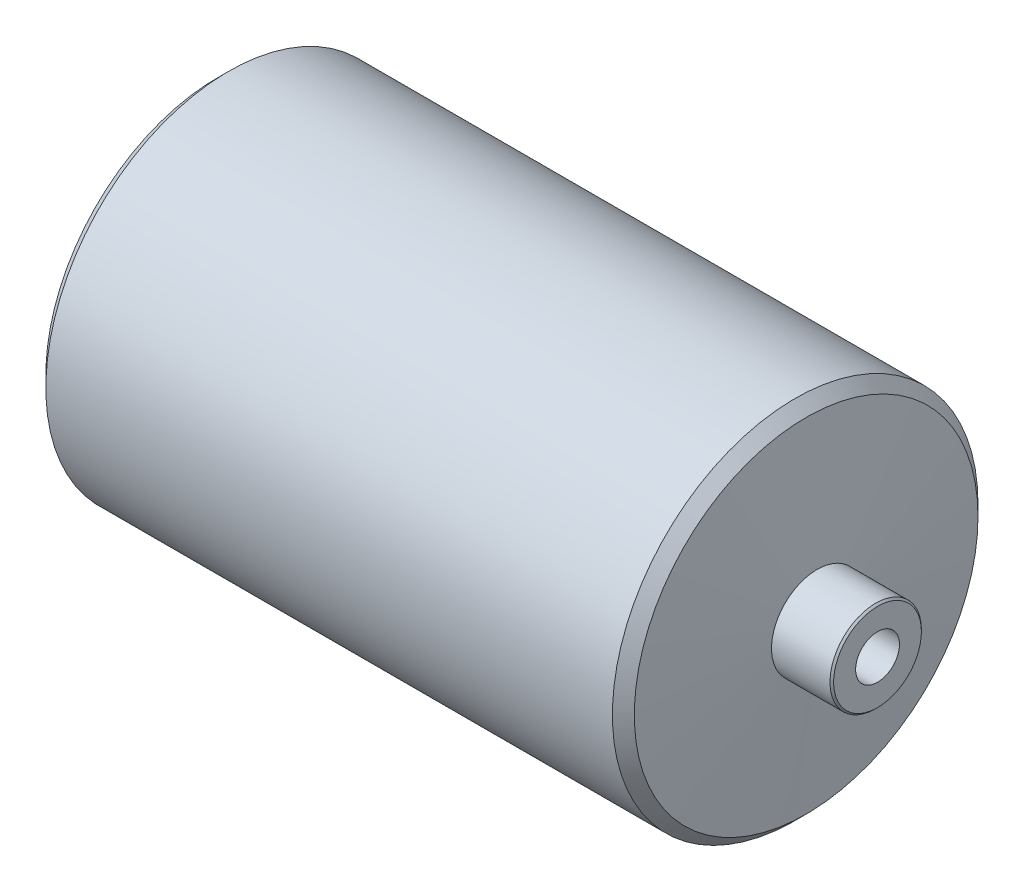
ISO-10303-21;
HEADER;
FILE_DESCRIPTION(('STEP AP214'),'2;1');
FILE_NAME('part.step','',(''),(''),'','','');
FILE_SCHEMA(('AUTOMOTIVE_DESIGN { 1 0 10303 214 1 1 1 1 }'));
ENDSEC;
DATA;
#1=APPLICATION_CONTEXT('core data for automotive mechanical design processes');
#2=APPLICATION_PROTOCOL_DEFINITION('international standard','automotive_design',2000,#1);
#3=PRODUCT_CONTEXT('',#1,'mechanical');
#4=PRODUCT('Part','Part','',(#3));
#5=PRODUCT_RELATED_PRODUCT_CATEGORY('part','',(#4));
#6=PRODUCT_DEFINITION_FORMATION('','',#4);
#7=PRODUCT_DEFINITION_CONTEXT('part definition',#1,'design');
#8=PRODUCT_DEFINITION('design','',#6,#7);
#9=PRODUCT_DEFINITION_SHAPE('','',#8);
#10=(LENGTH_UNIT() NAMED_UNIT(*) SI_UNIT(.MILLI.,.METRE.));
#11=(NAMED_UNIT(*) PLANE_ANGLE_UNIT() SI_UNIT($,.RADIAN.));
#12=(NAMED_UNIT(*) SI_UNIT($,.STERADIAN.) SOLID_ANGLE_UNIT());
#13=UNCERTAINTY_MEASURE_WITH_UNIT(LENGTH_MEASURE(1.E-05),#10,'distance_accuracy_value','');
#14=(GEOMETRIC_REPRESENTATION_CONTEXT(3) GLOBAL_UNCERTAINTY_ASSIGNED_CONTEXT((#13)) GLOBAL_UNIT_ASSIGNED_CONTEXT((#10,
#11,#12)) REPRESENTATION_CONTEXT('',''));
#15=CARTESIAN_POINT('',(0.,0.,0.));
#16=DIRECTION('',(0.,0.,1.));
#17=DIRECTION('',(1.,0.,0.));
#18=AXIS2_PLACEMENT_3D('',#15,#16,#17);
#19=CARTESIAN_POINT('',(-100.,0.,0.));
#20=DIRECTION('',(1.,0.,0.));
#21=DIRECTION('',(0.,0.,-1.));
#22=AXIS2_PLACEMENT_3D('',#19,#20,#21);
#23=PLANE('',#22);
#24=CARTESIAN_POINT('',(-100.,0.,0.));
#25=DIRECTION('',(-1.,0.,0.));
#26=DIRECTION('',(0.,0.,1.));
#27=AXIS2_PLACEMENT_3D('',#24,#25,#26);
#28=CIRCLE('',#27,5.99999999999999);
#29=CARTESIAN_POINT('',(-100.,0.,5.99999999999999));
#30=VERTEX_POINT('',#29);
#31=EDGE_CURVE('E56',#30,#30,#28,.T.);
#32=ORIENTED_EDGE('',*,*,#31,.F.);
#33=EDGE_LOOP('',(#32));
#34=FACE_BOUND('',#33,.T.);
#35=CARTESIAN_POINT('',(-100.,0.,0.));
#36=DIRECTION('',(1.,0.,0.));
#37=DIRECTION('',(0.,0.,-1.));
#38=AXIS2_PLACEMENT_3D('',#35,#36,#37);
#39=CIRCLE('',#38,12.);
#40=CARTESIAN_POINT('',(-100.,0.,-12.));
#41=VERTEX_POINT('',#40);
#42=EDGE_CURVE('E11',#41,#41,#39,.T.);
#43=ORIENTED_EDGE('',*,*,#42,.F.);
#44=EDGE_LOOP('',(#43));
#45=FACE_BOUND('',#44,.T.);
#46=ADVANCED_FACE('F33',(#34,#45),#23,.F.);
#47=CARTESIAN_POINT('',(-100.,0.,0.));
#48=DIRECTION('',(1.,0.,0.));
#49=DIRECTION('',(0.,0.,-1.));
#50=AXIS2_PLACEMENT_3D('',#47,#48,#49);
#51=CONICAL_SURFACE('',#50,12.,0.785398163397448);
#52=CARTESIAN_POINT('',(-99.5,0.,0.));
#53=DIRECTION('',(1.,0.,0.));
#54=DIRECTION('',(0.,0.,-1.));
#55=AXIS2_PLACEMENT_3D('',#52,#53,#54);
#56=CIRCLE('',#55,12.5);
#57=CARTESIAN_POINT('',(-99.5,0.,-12.5));
#58=VERTEX_POINT('',#57);
#59=EDGE_CURVE('E40',#58,#58,#56,.T.);
#60=ORIENTED_EDGE('',*,*,#59,.F.);
#61=EDGE_LOOP('',(#60));
#62=FACE_BOUND('',#61,.T.);
#63=ORIENTED_EDGE('',*,*,#42,.T.);
#64=EDGE_LOOP('',(#63));
#65=FACE_BOUND('',#64,.T.);
#66=ADVANCED_FACE('F95',(#62,#65),#51,.T.);
#67=CARTESIAN_POINT('',(112.244897959184,0.,0.));
#68=DIRECTION('',(1.,0.,0.));
#69=DIRECTION('',(0.,0.,-1.));
#70=AXIS2_PLACEMENT_3D('',#67,#68,#69);
#71=CYLINDRICAL_SURFACE('',#70,12.5);
#72=CARTESIAN_POINT('',(-83.5,0.,0.));
#73=DIRECTION('',(1.,0.,0.));
#74=DIRECTION('',(0.,0.,-1.));
#75=AXIS2_PLACEMENT_3D('',#72,#73,#74);
#76=CIRCLE('',#75,12.5);
#77=CARTESIAN_POINT('',(-83.5,0.,-12.5));
#78=VERTEX_POINT('',#77);
#79=EDGE_CURVE('E88',#78,#78,#76,.T.);
#80=ORIENTED_EDGE('',*,*,#79,.F.);
#81=EDGE_LOOP('',(#80));
#82=FACE_BOUND('',#81,.T.);
#83=ORIENTED_EDGE('',*,*,#59,.T.);
#84=EDGE_LOOP('',(#83));
#85=FACE_BOUND('',#84,.T.);
#86=ADVANCED_FACE('F93',(#82,#85),#71,.T.);
#87=CARTESIAN_POINT('',(-83.5,0.,0.));
#88=DIRECTION('',(1.,0.,0.));
#89=DIRECTION('',(0.,0.,-1.));
#90=AXIS2_PLACEMENT_3D('',#87,#88,#89);
#91=CONICAL_SURFACE('',#90,12.5,1.48352986419518);
#92=CARTESIAN_POINT('',(-80.4816411083557,0.,0.));
#93=DIRECTION('',(1.,0.,0.));
#94=DIRECTION('',(0.,0.,-1.));
#95=AXIS2_PLACEMENT_3D('',#92,#93,#94);
#96=CIRCLE('',#95,47.);
#97=CARTESIAN_POINT('',(-80.4816411083557,0.,-47.));
#98=VERTEX_POINT('',#97);
#99=EDGE_CURVE('E85',#98,#98,#96,.T.);
#100=ORIENTED_EDGE('',*,*,#99,.F.);
#101=EDGE_LOOP('',(#100));
#102=FACE_BOUND('',#101,.T.);
#103=ORIENTED_EDGE('',*,*,#79,.T.);
#104=EDGE_LOOP('',(#103));
#105=FACE_BOUND('',#104,.T.);
#106=ADVANCED_FACE('F144',(#102,#105),#91,.T.);
#107=CARTESIAN_POINT('',(-80.4816411083557,0.,0.));
#108=DIRECTION('',(1.,0.,0.));
#109=DIRECTION('',(0.,0.,-1.));
#110=AXIS2_PLACEMENT_3D('',#107,#108,#109);
#111=CONICAL_SURFACE('',#110,47.,0.785398163397448);
#112=CARTESIAN_POINT('',(-77.4816411083557,0.,0.));
#113=DIRECTION('',(1.,0.,0.));
#114=DIRECTION('',(0.,0.,-1.));
#115=AXIS2_PLACEMENT_3D('',#112,#113,#114);
#116=CIRCLE('',#115,50.);
#117=CARTESIAN_POINT('',(-77.4816411083557,0.,-50.));
#118=VERTEX_POINT('',#117);
#119=EDGE_CURVE('E82',#118,#118,#116,.T.);
#120=ORIENTED_EDGE('',*,*,#119,.F.);
#121=EDGE_LOOP('',(#120));
#122=FACE_BOUND('',#121,.T.);
#123=ORIENTED_EDGE('',*,*,#99,.T.);
#124=EDGE_LOOP('',(#123));
#125=FACE_BOUND('',#124,.T.);
#126=ADVANCED_FACE('F140',(#122,#125),#111,.T.);
#127=CARTESIAN_POINT('',(112.244897959184,0.,0.));
#128=DIRECTION('',(1.,0.,0.));
#129=DIRECTION('',(0.,0.,-1.));
#130=AXIS2_PLACEMENT_3D('',#127,#128,#129);
#131=CYLINDRICAL_SURFACE('',#130,50.);
#132=ORIENTED_EDGE('',*,*,#119,.T.);
#133=EDGE_LOOP('',(#132));
#134=FACE_BOUND('',#133,.T.);
#135=CARTESIAN_POINT('',(77.4816411083557,0.,0.));
#136=DIRECTION('',(1.,0.,0.));
#137=DIRECTION('',(0.,0.,-1.));
#138=AXIS2_PLACEMENT_3D('',#135,#136,#137);
#139=CIRCLE('',#138,50.);
#140=CARTESIAN_POINT('',(77.4816411083557,0.,-50.));
#141=VERTEX_POINT('',#140);
#142=EDGE_CURVE('E79',#141,#141,#139,.T.);
#143=ORIENTED_EDGE('',*,*,#142,.F.);
#144=EDGE_LOOP('',(#143));
#145=FACE_BOUND('',#144,.T.);
#146=ADVANCED_FACE('F136',(#134,#145),#131,.T.);
#147=CARTESIAN_POINT('',(80.4816411083557,0.,0.));
#148=DIRECTION('',(-1.,0.,0.));
#149=DIRECTION('',(0.,0.,1.));
#150=AXIS2_PLACEMENT_3D('',#147,#148,#149);
#151=CONICAL_SURFACE('',#150,47.,0.785398163397448);
#152=ORIENTED_EDGE('',*,*,#142,.T.);
#153=EDGE_LOOP('',(#152));
#154=FACE_BOUND('',#153,.T.);
#155=CARTESIAN_POINT('',(80.4816411083557,0.,0.));
#156=DIRECTION('',(1.,0.,0.));
#157=DIRECTION('',(0.,0.,-1.));
#158=AXIS2_PLACEMENT_3D('',#155,#156,#157);
#159=CIRCLE('',#158,47.);
#160=CARTESIAN_POINT('',(80.4816411083557,0.,-47.));
#161=VERTEX_POINT('',#160);
#162=EDGE_CURVE('E76',#161,#161,#159,.T.);
#163=ORIENTED_EDGE('',*,*,#162,.F.);
#164=EDGE_LOOP('',(#163));
#165=FACE_BOUND('',#164,.T.);
#166=ADVANCED_FACE('F132',(#154,#165),#151,.T.);
#167=CARTESIAN_POINT('',(83.5,0.,0.));
#168=DIRECTION('',(-1.,0.,0.));
#169=DIRECTION('',(0.,0.,1.));
#170=AXIS2_PLACEMENT_3D('',#167,#168,#169);
#171=CONICAL_SURFACE('',#170,12.5,1.48352986419518);
#172=ORIENTED_EDGE('',*,*,#162,.T.);
#173=EDGE_LOOP('',(#172));
#174=FACE_BOUND('',#173,.T.);
#175=CARTESIAN_POINT('',(83.5,0.,0.));
#176=DIRECTION('',(1.,0.,0.));
#177=DIRECTION('',(0.,0.,-1.));
#178=AXIS2_PLACEMENT_3D('',#175,#176,#177);
#179=CIRCLE('',#178,12.5);
#180=CARTESIAN_POINT('',(83.5,0.,-12.5));
#181=VERTEX_POINT('',#180);
#182=EDGE_CURVE('E73',#181,#181,#179,.T.);
#183=ORIENTED_EDGE('',*,*,#182,.F.);
#184=EDGE_LOOP('',(#183));
#185=FACE_BOUND('',#184,.T.);
#186=ADVANCED_FACE('F128',(#174,#185),#171,.T.);
#187=CARTESIAN_POINT('',(112.244897959184,0.,0.));
#188=DIRECTION('',(1.,0.,0.));
#189=DIRECTION('',(0.,0.,-1.));
#190=AXIS2_PLACEMENT_3D('',#187,#188,#189);
#191=CYLINDRICAL_SURFACE('',#190,12.5);
#192=ORIENTED_EDGE('',*,*,#182,.T.);
#193=EDGE_LOOP('',(#192));
#194=FACE_BOUND('',#193,.T.);
#195=CARTESIAN_POINT('',(99.5,0.,0.));
#196=DIRECTION('',(1.,0.,0.));
#197=DIRECTION('',(0.,0.,-1.));
#198=AXIS2_PLACEMENT_3D('',#195,#196,#197);
#199=CIRCLE('',#198,12.5);
#200=CARTESIAN_POINT('',(99.5,0.,-12.5));
#201=VERTEX_POINT('',#200);
#202=EDGE_CURVE('E70',#201,#201,#199,.T.);
#203=ORIENTED_EDGE('',*,*,#202,.F.);
#204=EDGE_LOOP('',(#203));
#205=FACE_BOUND('',#204,.T.);
#206=ADVANCED_FACE('F124',(#194,#205),#191,.T.);
#207=CARTESIAN_POINT('',(100.,0.,0.));
#208=DIRECTION('',(-1.,0.,0.));
#209=DIRECTION('',(0.,0.,1.));
#210=AXIS2_PLACEMENT_3D('',#207,#208,#209);
#211=CONICAL_SURFACE('',#210,12.,0.785398163397448);
#212=ORIENTED_EDGE('',*,*,#202,.T.);
#213=EDGE_LOOP('',(#212));
#214=FACE_BOUND('',#213,.T.);
#215=CARTESIAN_POINT('',(100.,0.,0.));
#216=DIRECTION('',(1.,0.,0.));
#217=DIRECTION('',(0.,0.,-1.));
#218=AXIS2_PLACEMENT_3D('',#215,#216,#217);
#219=CIRCLE('',#218,12.);
#220=CARTESIAN_POINT('',(100.,0.,-12.));
#221=VERTEX_POINT('',#220);
#222=EDGE_CURVE('E67',#221,#221,#219,.T.);
#223=ORIENTED_EDGE('',*,*,#222,.F.);
#224=EDGE_LOOP('',(#223));
#225=FACE_BOUND('',#224,.T.);
#226=ADVANCED_FACE('F120',(#214,#225),#211,.T.);
#227=CARTESIAN_POINT('',(100.,0.,0.));
#228=DIRECTION('',(1.,0.,0.));
#229=DIRECTION('',(0.,0.,-1.));
#230=AXIS2_PLACEMENT_3D('',#227,#228,#229);
#231=PLANE('',#230);
#232=CARTESIAN_POINT('',(100.,0.,0.));
#233=DIRECTION('',(1.,0.,0.));
#234=DIRECTION('',(0.,0.,-1.));
#235=AXIS2_PLACEMENT_3D('',#232,#233,#234);
#236=CIRCLE('',#235,5.99999999999999);
#237=CARTESIAN_POINT('',(100.,0.,-5.99999999999999));
#238=VERTEX_POINT('',#237);
#239=EDGE_CURVE('E57',#238,#238,#236,.T.);
#240=ORIENTED_EDGE('',*,*,#239,.F.);
#241=EDGE_LOOP('',(#240));
#242=FACE_BOUND('',#241,.T.);
#243=ORIENTED_EDGE('',*,*,#222,.T.);
#244=EDGE_LOOP('',(#243));
#245=FACE_BOUND('',#244,.T.);
#246=ADVANCED_FACE('F113',(#242,#245),#231,.T.);
#247=CARTESIAN_POINT('',(-44.6051637141654,0.,0.));
#248=DIRECTION('',(-1.,0.,0.));
#249=DIRECTION('',(0.,0.,1.));
#250=AXIS2_PLACEMENT_3D('',#247,#248,#249);
#251=CONICAL_SURFACE('',#250,5.99999999999999,1.02974425867665);
#252=CARTESIAN_POINT('',(-41.,0.,0.));
#253=VERTEX_POINT('',#252);
#254=VERTEX_LOOP('',#253);
#255=FACE_BOUND('',#254,.T.);
#256=CARTESIAN_POINT('',(-44.6051637141654,0.,0.));
#257=DIRECTION('',(-1.,0.,0.));
#258=DIRECTION('',(0.,0.,1.));
#259=AXIS2_PLACEMENT_3D('',#256,#257,#258);
#260=CIRCLE('',#259,5.99999999999999);
#261=CARTESIAN_POINT('',(-44.6051637141654,0.,5.99999999999999));
#262=VERTEX_POINT('',#261);
#263=EDGE_CURVE('E60',#262,#262,#260,.T.);
#264=ORIENTED_EDGE('',*,*,#263,.T.);
#265=EDGE_LOOP('',(#264));
#266=FACE_BOUND('',#265,.T.);
#267=ADVANCED_FACE('F107',(#255,#266),#251,.F.);
#268=CARTESIAN_POINT('',(-100.,0.,0.));
#269=DIRECTION('',(-1.,0.,0.));
#270=DIRECTION('',(0.,0.,1.));
#271=AXIS2_PLACEMENT_3D('',#268,#269,#270);
#272=CYLINDRICAL_SURFACE('',#271,5.99999999999999);
#273=ORIENTED_EDGE('',*,*,#263,.F.);
#274=EDGE_LOOP('',(#273));
#275=FACE_BOUND('',#274,.T.);
#276=ORIENTED_EDGE('',*,*,#31,.T.);
#277=EDGE_LOOP('',(#276));
#278=FACE_BOUND('',#277,.T.);
#279=ADVANCED_FACE('F50',(#275,#278),#272,.F.);
#280=CARTESIAN_POINT('',(44.6051637141654,0.,0.));
#281=DIRECTION('',(1.,0.,0.));
#282=DIRECTION('',(0.,0.,-1.));
#283=AXIS2_PLACEMENT_3D('',#280,#281,#282);
#284=CONICAL_SURFACE('',#283,5.99999999999999,1.02974425867665);
#285=CARTESIAN_POINT('',(41.,0.,0.));
#286=VERTEX_POINT('',#285);
#287=VERTEX_LOOP('',#286);
#288=FACE_BOUND('',#287,.T.);
#289=CARTESIAN_POINT('',(44.6051637141654,0.,0.));
#290=DIRECTION('',(1.,0.,0.));
#291=DIRECTION('',(0.,0.,-1.));
#292=AXIS2_PLACEMENT_3D('',#289,#290,#291);
#293=CIRCLE('',#292,5.99999999999999);
#294=CARTESIAN_POINT('',(44.6051637141654,0.,-5.99999999999999));
#295=VERTEX_POINT('',#294);
#296=EDGE_CURVE('E54',#295,#295,#293,.T.);
#297=ORIENTED_EDGE('',*,*,#296,.T.);
#298=EDGE_LOOP('',(#297));
#299=FACE_BOUND('',#298,.T.);
#300=ADVANCED_FACE('F46',(#288,#299),#284,.F.);
#301=CARTESIAN_POINT('',(100.,0.,0.));
#302=DIRECTION('',(1.,0.,0.));
#303=DIRECTION('',(0.,0.,-1.));
#304=AXIS2_PLACEMENT_3D('',#301,#302,#303);
#305=CYLINDRICAL_SURFACE('',#304,5.99999999999999);
#306=ORIENTED_EDGE('',*,*,#296,.F.);
#307=EDGE_LOOP('',(#306));
#308=FACE_BOUND('',#307,.T.);
#309=ORIENTED_EDGE('',*,*,#239,.T.);
#310=EDGE_LOOP('',(#309));
#311=FACE_BOUND('',#310,.T.);
#312=ADVANCED_FACE('F49',(#308,#311),#305,.F.);
#313=CLOSED_SHELL('',(#46,#66,#86,#106,#126,#146,#166,#186,#206,#226,#246,#267,#279,#300,#312));
#314=MANIFOLD_SOLID_BREP('B2',#313);
#315=ADVANCED_BREP_SHAPE_REPRESENTATION('',(#18,#314),#14);
#316=SHAPE_DEFINITION_REPRESENTATION(#9,#315);
ENDSEC;
END-ISO-10303-21;
